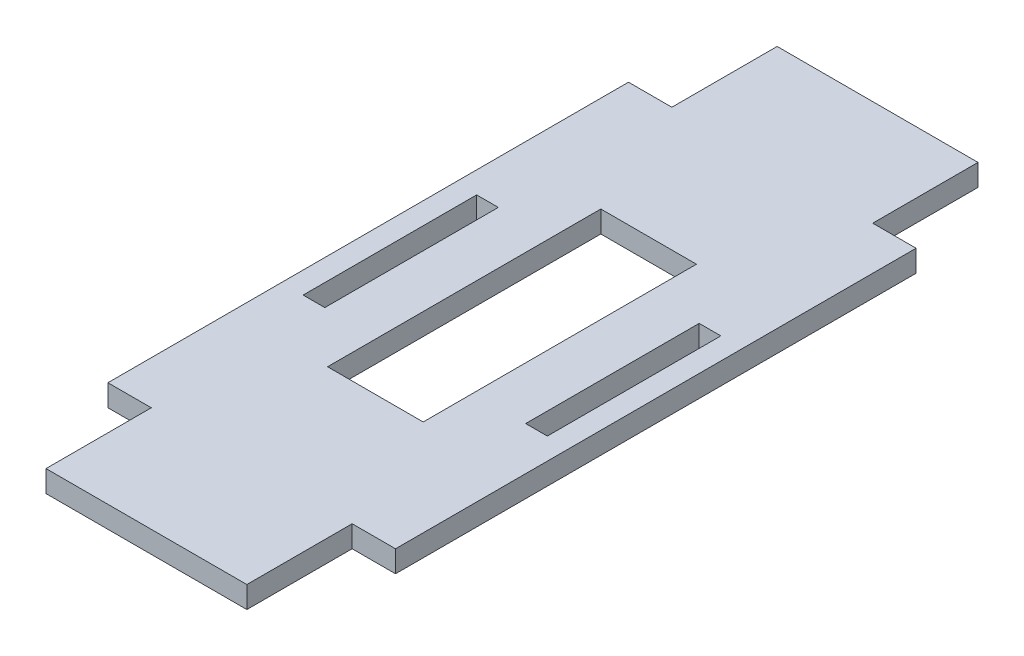
ISO-10303-21;
HEADER;
FILE_DESCRIPTION(('STEP AP214'),'2;1');
FILE_NAME('part.step','',(''),(''),'','','');
FILE_SCHEMA(('AUTOMOTIVE_DESIGN { 1 0 10303 214 1 1 1 1 }'));
ENDSEC;
DATA;
#1=APPLICATION_CONTEXT('core data for automotive mechanical design processes');
#2=APPLICATION_PROTOCOL_DEFINITION('international standard','automotive_design',2000,#1);
#3=PRODUCT_CONTEXT('',#1,'mechanical');
#4=PRODUCT('Part','Part','',(#3));
#5=PRODUCT_RELATED_PRODUCT_CATEGORY('part','',(#4));
#6=PRODUCT_DEFINITION_FORMATION('','',#4);
#7=PRODUCT_DEFINITION_CONTEXT('part definition',#1,'design');
#8=PRODUCT_DEFINITION('design','',#6,#7);
#9=PRODUCT_DEFINITION_SHAPE('','',#8);
#10=(LENGTH_UNIT() NAMED_UNIT(*) SI_UNIT(.MILLI.,.METRE.));
#11=(NAMED_UNIT(*) PLANE_ANGLE_UNIT() SI_UNIT($,.RADIAN.));
#12=(NAMED_UNIT(*) SI_UNIT($,.STERADIAN.) SOLID_ANGLE_UNIT());
#13=UNCERTAINTY_MEASURE_WITH_UNIT(LENGTH_MEASURE(1.E-05),#10,'distance_accuracy_value','');
#14=(GEOMETRIC_REPRESENTATION_CONTEXT(3) GLOBAL_UNCERTAINTY_ASSIGNED_CONTEXT((#13)) GLOBAL_UNIT_ASSIGNED_CONTEXT((#10,
#11,#12)) REPRESENTATION_CONTEXT('',''));
#15=CARTESIAN_POINT('',(0.,0.,0.));
#16=DIRECTION('',(0.,0.,1.));
#17=DIRECTION('',(1.,0.,0.));
#18=AXIS2_PLACEMENT_3D('',#15,#16,#17);
#19=CARTESIAN_POINT('',(0.,3.175,38.1));
#20=DIRECTION('',(0.,0.,-1.));
#21=DIRECTION('',(-1.,0.,0.));
#22=AXIS2_PLACEMENT_3D('',#19,#20,#21);
#23=PLANE('',#22);
#24=DIRECTION('',(1.,0.,0.));
#25=VECTOR('',#24,1.);
#26=CARTESIAN_POINT('',(0.,0.,38.1));
#27=LINE('',#26,#25);
#28=CARTESIAN_POINT('',(-21.05,0.,38.1));
#29=VERTEX_POINT('',#28);
#30=CARTESIAN_POINT('',(-14.7,0.,38.1));
#31=VERTEX_POINT('',#30);
#32=EDGE_CURVE('E271',#29,#31,#27,.T.);
#33=ORIENTED_EDGE('',*,*,#32,.T.);
#34=DIRECTION('',(0.,-1.,0.));
#35=VECTOR('',#34,1.);
#36=CARTESIAN_POINT('',(-14.7,3.175,38.1));
#37=LINE('',#36,#35);
#38=CARTESIAN_POINT('',(-14.7,3.175,38.1));
#39=VERTEX_POINT('',#38);
#40=EDGE_CURVE('E11',#39,#31,#37,.T.);
#41=ORIENTED_EDGE('',*,*,#40,.F.);
#42=DIRECTION('',(1.,0.,0.));
#43=VECTOR('',#42,1.);
#44=CARTESIAN_POINT('',(0.,3.175,38.1));
#45=LINE('',#44,#43);
#46=CARTESIAN_POINT('',(-21.05,3.175,38.1));
#47=VERTEX_POINT('',#46);
#48=EDGE_CURVE('E391',#47,#39,#45,.T.);
#49=ORIENTED_EDGE('',*,*,#48,.F.);
#50=DIRECTION('',(0.,-1.,0.));
#51=VECTOR('',#50,1.);
#52=CARTESIAN_POINT('',(-21.05,3.175,38.1));
#53=LINE('',#52,#51);
#54=EDGE_CURVE('E296',#47,#29,#53,.T.);
#55=ORIENTED_EDGE('',*,*,#54,.T.);
#56=EDGE_LOOP('',(#33,#41,#49,#55));
#57=FACE_BOUND('',#56,.T.);
#58=ADVANCED_FACE('F41',(#57),#23,.F.);
#59=CARTESIAN_POINT('',(-14.7,3.175,0.));
#60=DIRECTION('',(1.,0.,0.));
#61=DIRECTION('',(0.,0.,-1.));
#62=AXIS2_PLACEMENT_3D('',#59,#60,#61);
#63=PLANE('',#62);
#64=DIRECTION('',(0.,0.,1.));
#65=VECTOR('',#64,1.);
#66=CARTESIAN_POINT('',(-14.7,0.,0.));
#67=LINE('',#66,#65);
#68=CARTESIAN_POINT('',(-14.7,0.,53.51285));
#69=VERTEX_POINT('',#68);
#70=EDGE_CURVE('E274',#31,#69,#67,.T.);
#71=ORIENTED_EDGE('',*,*,#70,.T.);
#72=DIRECTION('',(0.,-1.,0.));
#73=VECTOR('',#72,1.);
#74=CARTESIAN_POINT('',(-14.7,3.175,53.51285));
#75=LINE('',#74,#73);
#76=CARTESIAN_POINT('',(-14.7,3.175,53.51285));
#77=VERTEX_POINT('',#76);
#78=EDGE_CURVE('E51',#77,#69,#75,.T.);
#79=ORIENTED_EDGE('',*,*,#78,.F.);
#80=DIRECTION('',(0.,0.,1.));
#81=VECTOR('',#80,1.);
#82=CARTESIAN_POINT('',(-14.7,3.175,0.));
#83=LINE('',#82,#81);
#84=EDGE_CURVE('E393',#39,#77,#83,.T.);
#85=ORIENTED_EDGE('',*,*,#84,.F.);
#86=ORIENTED_EDGE('',*,*,#40,.T.);
#87=EDGE_LOOP('',(#71,#79,#85,#86));
#88=FACE_BOUND('',#87,.T.);
#89=ADVANCED_FACE('F437',(#88),#63,.F.);
#90=CARTESIAN_POINT('',(0.,3.175,53.51285));
#91=DIRECTION('',(0.,0.,-1.));
#92=DIRECTION('',(-1.,0.,0.));
#93=AXIS2_PLACEMENT_3D('',#90,#91,#92);
#94=PLANE('',#93);
#95=DIRECTION('',(1.,0.,0.));
#96=VECTOR('',#95,1.);
#97=CARTESIAN_POINT('',(0.,0.,53.51285));
#98=LINE('',#97,#96);
#99=CARTESIAN_POINT('',(14.7,0.,53.51285));
#100=VERTEX_POINT('',#99);
#101=EDGE_CURVE('E276',#69,#100,#98,.T.);
#102=ORIENTED_EDGE('',*,*,#101,.T.);
#103=DIRECTION('',(0.,-1.,0.));
#104=VECTOR('',#103,1.);
#105=CARTESIAN_POINT('',(14.7,3.175,53.51285));
#106=LINE('',#105,#104);
#107=CARTESIAN_POINT('',(14.7,3.175,53.51285));
#108=VERTEX_POINT('',#107);
#109=EDGE_CURVE('E314',#108,#100,#106,.T.);
#110=ORIENTED_EDGE('',*,*,#109,.F.);
#111=DIRECTION('',(1.,0.,0.));
#112=VECTOR('',#111,1.);
#113=CARTESIAN_POINT('',(0.,3.175,53.51285));
#114=LINE('',#113,#112);
#115=EDGE_CURVE('E395',#77,#108,#114,.T.);
#116=ORIENTED_EDGE('',*,*,#115,.F.);
#117=ORIENTED_EDGE('',*,*,#78,.T.);
#118=EDGE_LOOP('',(#102,#110,#116,#117));
#119=FACE_BOUND('',#118,.T.);
#120=ADVANCED_FACE('F442',(#119),#94,.F.);
#121=CARTESIAN_POINT('',(14.7,3.175,0.));
#122=DIRECTION('',(-1.,0.,0.));
#123=DIRECTION('',(0.,0.,1.));
#124=AXIS2_PLACEMENT_3D('',#121,#122,#123);
#125=PLANE('',#124);
#126=DIRECTION('',(0.,0.,-1.));
#127=VECTOR('',#126,1.);
#128=CARTESIAN_POINT('',(14.7,0.,0.));
#129=LINE('',#128,#127);
#130=CARTESIAN_POINT('',(14.7,0.,38.1));
#131=VERTEX_POINT('',#130);
#132=EDGE_CURVE('E278',#100,#131,#129,.T.);
#133=ORIENTED_EDGE('',*,*,#132,.T.);
#134=DIRECTION('',(0.,-1.,0.));
#135=VECTOR('',#134,1.);
#136=CARTESIAN_POINT('',(14.7,3.175,38.1));
#137=LINE('',#136,#135);
#138=CARTESIAN_POINT('',(14.7,3.175,38.1));
#139=VERTEX_POINT('',#138);
#140=EDGE_CURVE('E311',#139,#131,#137,.T.);
#141=ORIENTED_EDGE('',*,*,#140,.F.);
#142=DIRECTION('',(0.,0.,-1.));
#143=VECTOR('',#142,1.);
#144=CARTESIAN_POINT('',(14.7,3.175,0.));
#145=LINE('',#144,#143);
#146=EDGE_CURVE('E397',#108,#139,#145,.T.);
#147=ORIENTED_EDGE('',*,*,#146,.F.);
#148=ORIENTED_EDGE('',*,*,#109,.T.);
#149=EDGE_LOOP('',(#133,#141,#147,#148));
#150=FACE_BOUND('',#149,.T.);
#151=ADVANCED_FACE('F570',(#150),#125,.F.);
#152=CARTESIAN_POINT('',(0.,3.175,38.1));
#153=DIRECTION('',(0.,0.,-1.));
#154=DIRECTION('',(-1.,0.,0.));
#155=AXIS2_PLACEMENT_3D('',#152,#153,#154);
#156=PLANE('',#155);
#157=DIRECTION('',(1.,0.,0.));
#158=VECTOR('',#157,1.);
#159=CARTESIAN_POINT('',(0.,0.,38.1));
#160=LINE('',#159,#158);
#161=CARTESIAN_POINT('',(21.05,0.,38.1));
#162=VERTEX_POINT('',#161);
#163=EDGE_CURVE('E280',#131,#162,#160,.T.);
#164=ORIENTED_EDGE('',*,*,#163,.T.);
#165=DIRECTION('',(0.,-1.,0.));
#166=VECTOR('',#165,1.);
#167=CARTESIAN_POINT('',(21.05,3.175,38.1));
#168=LINE('',#167,#166);
#169=CARTESIAN_POINT('',(21.05,3.175,38.1));
#170=VERTEX_POINT('',#169);
#171=EDGE_CURVE('E309',#170,#162,#168,.T.);
#172=ORIENTED_EDGE('',*,*,#171,.F.);
#173=DIRECTION('',(1.,0.,0.));
#174=VECTOR('',#173,1.);
#175=CARTESIAN_POINT('',(0.,3.175,38.1));
#176=LINE('',#175,#174);
#177=EDGE_CURVE('E399',#139,#170,#176,.T.);
#178=ORIENTED_EDGE('',*,*,#177,.F.);
#179=ORIENTED_EDGE('',*,*,#140,.T.);
#180=EDGE_LOOP('',(#164,#172,#178,#179));
#181=FACE_BOUND('',#180,.T.);
#182=ADVANCED_FACE('F561',(#181),#156,.F.);
#183=CARTESIAN_POINT('',(21.05,3.175,0.));
#184=DIRECTION('',(1.,0.,0.));
#185=DIRECTION('',(0.,0.,-1.));
#186=AXIS2_PLACEMENT_3D('',#183,#184,#185);
#187=PLANE('',#186);
#188=DIRECTION('',(0.,0.,1.));
#189=VECTOR('',#188,1.);
#190=CARTESIAN_POINT('',(21.05,0.,0.));
#191=LINE('',#190,#189);
#192=CARTESIAN_POINT('',(21.05,0.,-38.1));
#193=VERTEX_POINT('',#192);
#194=EDGE_CURVE('E283',#193,#162,#191,.T.);
#195=ORIENTED_EDGE('',*,*,#194,.F.);
#196=DIRECTION('',(0.,-1.,0.));
#197=VECTOR('',#196,1.);
#198=CARTESIAN_POINT('',(21.05,3.175,-38.1));
#199=LINE('',#198,#197);
#200=CARTESIAN_POINT('',(21.05,3.175,-38.1));
#201=VERTEX_POINT('',#200);
#202=EDGE_CURVE('E307',#201,#193,#199,.T.);
#203=ORIENTED_EDGE('',*,*,#202,.F.);
#204=DIRECTION('',(0.,0.,1.));
#205=VECTOR('',#204,1.);
#206=CARTESIAN_POINT('',(21.05,3.175,0.));
#207=LINE('',#206,#205);
#208=EDGE_CURVE('E401',#201,#170,#207,.T.);
#209=ORIENTED_EDGE('',*,*,#208,.T.);
#210=ORIENTED_EDGE('',*,*,#171,.T.);
#211=EDGE_LOOP('',(#195,#203,#209,#210));
#212=FACE_BOUND('',#211,.T.);
#213=ADVANCED_FACE('F552',(#212),#187,.T.);
#214=CARTESIAN_POINT('',(0.,3.175,-38.1));
#215=DIRECTION('',(0.,0.,1.));
#216=DIRECTION('',(1.,0.,0.));
#217=AXIS2_PLACEMENT_3D('',#214,#215,#216);
#218=PLANE('',#217);
#219=DIRECTION('',(-1.,0.,0.));
#220=VECTOR('',#219,1.);
#221=CARTESIAN_POINT('',(0.,0.,-38.1));
#222=LINE('',#221,#220);
#223=CARTESIAN_POINT('',(14.7,0.,-38.1));
#224=VERTEX_POINT('',#223);
#225=EDGE_CURVE('E286',#193,#224,#222,.T.);
#226=ORIENTED_EDGE('',*,*,#225,.T.);
#227=DIRECTION('',(0.,-1.,0.));
#228=VECTOR('',#227,1.);
#229=CARTESIAN_POINT('',(14.7,3.175,-38.1));
#230=LINE('',#229,#228);
#231=CARTESIAN_POINT('',(14.7,3.175,-38.1));
#232=VERTEX_POINT('',#231);
#233=EDGE_CURVE('E304',#232,#224,#230,.T.);
#234=ORIENTED_EDGE('',*,*,#233,.F.);
#235=DIRECTION('',(-1.,0.,0.));
#236=VECTOR('',#235,1.);
#237=CARTESIAN_POINT('',(0.,3.175,-38.1));
#238=LINE('',#237,#236);
#239=EDGE_CURVE('E404',#201,#232,#238,.T.);
#240=ORIENTED_EDGE('',*,*,#239,.F.);
#241=ORIENTED_EDGE('',*,*,#202,.T.);
#242=EDGE_LOOP('',(#226,#234,#240,#241));
#243=FACE_BOUND('',#242,.T.);
#244=ADVANCED_FACE('F544',(#243),#218,.F.);
#245=CARTESIAN_POINT('',(14.7,3.175,0.));
#246=DIRECTION('',(-1.,0.,0.));
#247=DIRECTION('',(0.,0.,1.));
#248=AXIS2_PLACEMENT_3D('',#245,#246,#247);
#249=PLANE('',#248);
#250=DIRECTION('',(0.,0.,-1.));
#251=VECTOR('',#250,1.);
#252=CARTESIAN_POINT('',(14.7,0.,0.));
#253=LINE('',#252,#251);
#254=CARTESIAN_POINT('',(14.7,0.,-53.51285));
#255=VERTEX_POINT('',#254);
#256=EDGE_CURVE('E288',#224,#255,#253,.T.);
#257=ORIENTED_EDGE('',*,*,#256,.T.);
#258=DIRECTION('',(0.,-1.,0.));
#259=VECTOR('',#258,1.);
#260=CARTESIAN_POINT('',(14.7,3.175,-53.51285));
#261=LINE('',#260,#259);
#262=CARTESIAN_POINT('',(14.7,3.175,-53.51285));
#263=VERTEX_POINT('',#262);
#264=EDGE_CURVE('E301',#263,#255,#261,.T.);
#265=ORIENTED_EDGE('',*,*,#264,.F.);
#266=DIRECTION('',(0.,0.,-1.));
#267=VECTOR('',#266,1.);
#268=CARTESIAN_POINT('',(14.7,3.175,0.));
#269=LINE('',#268,#267);
#270=EDGE_CURVE('E406',#232,#263,#269,.T.);
#271=ORIENTED_EDGE('',*,*,#270,.F.);
#272=ORIENTED_EDGE('',*,*,#233,.T.);
#273=EDGE_LOOP('',(#257,#265,#271,#272));
#274=FACE_BOUND('',#273,.T.);
#275=ADVANCED_FACE('F413',(#274),#249,.F.);
#276=CARTESIAN_POINT('',(0.,3.175,-53.51285));
#277=DIRECTION('',(0.,0.,1.));
#278=DIRECTION('',(1.,0.,0.));
#279=AXIS2_PLACEMENT_3D('',#276,#277,#278);
#280=PLANE('',#279);
#281=DIRECTION('',(-1.,0.,0.));
#282=VECTOR('',#281,1.);
#283=CARTESIAN_POINT('',(0.,0.,-53.51285));
#284=LINE('',#283,#282);
#285=CARTESIAN_POINT('',(-14.7,0.,-53.51285));
#286=VERTEX_POINT('',#285);
#287=EDGE_CURVE('E290',#255,#286,#284,.T.);
#288=ORIENTED_EDGE('',*,*,#287,.T.);
#289=DIRECTION('',(0.,-1.,0.));
#290=VECTOR('',#289,1.);
#291=CARTESIAN_POINT('',(-14.7,3.175,-53.51285));
#292=LINE('',#291,#290);
#293=CARTESIAN_POINT('',(-14.7,3.175,-53.51285));
#294=VERTEX_POINT('',#293);
#295=EDGE_CURVE('E228',#294,#286,#292,.T.);
#296=ORIENTED_EDGE('',*,*,#295,.F.);
#297=DIRECTION('',(-1.,0.,0.));
#298=VECTOR('',#297,1.);
#299=CARTESIAN_POINT('',(0.,3.175,-53.51285));
#300=LINE('',#299,#298);
#301=EDGE_CURVE('E219',#263,#294,#300,.T.);
#302=ORIENTED_EDGE('',*,*,#301,.F.);
#303=ORIENTED_EDGE('',*,*,#264,.T.);
#304=EDGE_LOOP('',(#288,#296,#302,#303));
#305=FACE_BOUND('',#304,.T.);
#306=ADVANCED_FACE('F417',(#305),#280,.F.);
#307=CARTESIAN_POINT('',(-14.7,3.175,0.));
#308=DIRECTION('',(1.,0.,0.));
#309=DIRECTION('',(0.,0.,-1.));
#310=AXIS2_PLACEMENT_3D('',#307,#308,#309);
#311=PLANE('',#310);
#312=DIRECTION('',(0.,0.,1.));
#313=VECTOR('',#312,1.);
#314=CARTESIAN_POINT('',(-14.7,0.,0.));
#315=LINE('',#314,#313);
#316=CARTESIAN_POINT('',(-14.7,0.,-38.1));
#317=VERTEX_POINT('',#316);
#318=EDGE_CURVE('E227',#286,#317,#315,.T.);
#319=ORIENTED_EDGE('',*,*,#318,.T.);
#320=DIRECTION('',(0.,-1.,0.));
#321=VECTOR('',#320,1.);
#322=CARTESIAN_POINT('',(-14.7,3.175,-38.1));
#323=LINE('',#322,#321);
#324=CARTESIAN_POINT('',(-14.7,3.175,-38.1));
#325=VERTEX_POINT('',#324);
#326=EDGE_CURVE('E224',#325,#317,#323,.T.);
#327=ORIENTED_EDGE('',*,*,#326,.F.);
#328=DIRECTION('',(0.,0.,1.));
#329=VECTOR('',#328,1.);
#330=CARTESIAN_POINT('',(-14.7,3.175,0.));
#331=LINE('',#330,#329);
#332=EDGE_CURVE('E213',#294,#325,#331,.T.);
#333=ORIENTED_EDGE('',*,*,#332,.F.);
#334=ORIENTED_EDGE('',*,*,#295,.T.);
#335=EDGE_LOOP('',(#319,#327,#333,#334));
#336=FACE_BOUND('',#335,.T.);
#337=ADVANCED_FACE('F225',(#336),#311,.F.);
#338=CARTESIAN_POINT('',(0.,3.175,-38.1));
#339=DIRECTION('',(0.,0.,1.));
#340=DIRECTION('',(1.,0.,0.));
#341=AXIS2_PLACEMENT_3D('',#338,#339,#340);
#342=PLANE('',#341);
#343=DIRECTION('',(-1.,0.,0.));
#344=VECTOR('',#343,1.);
#345=CARTESIAN_POINT('',(0.,0.,-38.1));
#346=LINE('',#345,#344);
#347=CARTESIAN_POINT('',(-21.05,0.,-38.1));
#348=VERTEX_POINT('',#347);
#349=EDGE_CURVE('E137',#317,#348,#346,.T.);
#350=ORIENTED_EDGE('',*,*,#349,.T.);
#351=DIRECTION('',(0.,-1.,0.));
#352=VECTOR('',#351,1.);
#353=CARTESIAN_POINT('',(-21.05,3.175,-38.1));
#354=LINE('',#353,#352);
#355=CARTESIAN_POINT('',(-21.05,3.175,-38.1));
#356=VERTEX_POINT('',#355);
#357=EDGE_CURVE('E229',#356,#348,#354,.T.);
#358=ORIENTED_EDGE('',*,*,#357,.F.);
#359=DIRECTION('',(-1.,0.,0.));
#360=VECTOR('',#359,1.);
#361=CARTESIAN_POINT('',(0.,3.175,-38.1));
#362=LINE('',#361,#360);
#363=EDGE_CURVE('E217',#325,#356,#362,.T.);
#364=ORIENTED_EDGE('',*,*,#363,.F.);
#365=ORIENTED_EDGE('',*,*,#326,.T.);
#366=EDGE_LOOP('',(#350,#358,#364,#365));
#367=FACE_BOUND('',#366,.T.);
#368=ADVANCED_FACE('F231',(#367),#342,.F.);
#369=CARTESIAN_POINT('',(7.,3.175,0.));
#370=DIRECTION('',(-1.,0.,0.));
#371=DIRECTION('',(0.,0.,1.));
#372=AXIS2_PLACEMENT_3D('',#369,#370,#371);
#373=PLANE('',#372);
#374=DIRECTION('',(0.,0.,-1.));
#375=VECTOR('',#374,1.);
#376=CARTESIAN_POINT('',(7.,0.,0.));
#377=LINE('',#376,#375);
#378=CARTESIAN_POINT('',(7.,0.,20.));
#379=VERTEX_POINT('',#378);
#380=CARTESIAN_POINT('',(7.,0.,-20.));
#381=VERTEX_POINT('',#380);
#382=EDGE_CURVE('E259',#379,#381,#377,.T.);
#383=ORIENTED_EDGE('',*,*,#382,.F.);
#384=DIRECTION('',(0.,-1.,0.));
#385=VECTOR('',#384,1.);
#386=CARTESIAN_POINT('',(7.,3.175,20.));
#387=LINE('',#386,#385);
#388=CARTESIAN_POINT('',(7.,3.175,20.));
#389=VERTEX_POINT('',#388);
#390=EDGE_CURVE('E298',#389,#379,#387,.T.);
#391=ORIENTED_EDGE('',*,*,#390,.F.);
#392=DIRECTION('',(0.,0.,-1.));
#393=VECTOR('',#392,1.);
#394=CARTESIAN_POINT('',(7.,3.175,0.));
#395=LINE('',#394,#393);
#396=CARTESIAN_POINT('',(7.,3.175,-20.));
#397=VERTEX_POINT('',#396);
#398=EDGE_CURVE('E380',#389,#397,#395,.T.);
#399=ORIENTED_EDGE('',*,*,#398,.T.);
#400=DIRECTION('',(0.,-1.,0.));
#401=VECTOR('',#400,1.);
#402=CARTESIAN_POINT('',(7.,3.175,-20.));
#403=LINE('',#402,#401);
#404=EDGE_CURVE('E319',#397,#381,#403,.T.);
#405=ORIENTED_EDGE('',*,*,#404,.T.);
#406=EDGE_LOOP('',(#383,#391,#399,#405));
#407=FACE_BOUND('',#406,.T.);
#408=ADVANCED_FACE('F459',(#407),#373,.T.);
#409=CARTESIAN_POINT('',(0.,3.175,20.));
#410=DIRECTION('',(0.,0.,-1.));
#411=DIRECTION('',(-1.,0.,0.));
#412=AXIS2_PLACEMENT_3D('',#409,#410,#411);
#413=PLANE('',#412);
#414=DIRECTION('',(1.,0.,0.));
#415=VECTOR('',#414,1.);
#416=CARTESIAN_POINT('',(0.,0.,20.));
#417=LINE('',#416,#415);
#418=CARTESIAN_POINT('',(-7.,0.,20.));
#419=VERTEX_POINT('',#418);
#420=EDGE_CURVE('E262',#419,#379,#417,.T.);
#421=ORIENTED_EDGE('',*,*,#420,.F.);
#422=DIRECTION('',(0.,-1.,0.));
#423=VECTOR('',#422,1.);
#424=CARTESIAN_POINT('',(-7.,3.175,20.));
#425=LINE('',#424,#423);
#426=CARTESIAN_POINT('',(-7.,3.175,20.));
#427=VERTEX_POINT('',#426);
#428=EDGE_CURVE('E325',#427,#419,#425,.T.);
#429=ORIENTED_EDGE('',*,*,#428,.F.);
#430=DIRECTION('',(1.,0.,0.));
#431=VECTOR('',#430,1.);
#432=CARTESIAN_POINT('',(0.,3.175,20.));
#433=LINE('',#432,#431);
#434=EDGE_CURVE('E383',#427,#389,#433,.T.);
#435=ORIENTED_EDGE('',*,*,#434,.T.);
#436=ORIENTED_EDGE('',*,*,#390,.T.);
#437=EDGE_LOOP('',(#421,#429,#435,#436));
#438=FACE_BOUND('',#437,.T.);
#439=ADVANCED_FACE('F455',(#438),#413,.T.);
#440=CARTESIAN_POINT('',(-7.,3.175,0.));
#441=DIRECTION('',(-1.,0.,0.));
#442=DIRECTION('',(0.,0.,1.));
#443=AXIS2_PLACEMENT_3D('',#440,#441,#442);
#444=PLANE('',#443);
#445=DIRECTION('',(0.,0.,-1.));
#446=VECTOR('',#445,1.);
#447=CARTESIAN_POINT('',(-7.,0.,0.));
#448=LINE('',#447,#446);
#449=CARTESIAN_POINT('',(-7.,0.,-20.));
#450=VERTEX_POINT('',#449);
#451=EDGE_CURVE('E265',#419,#450,#448,.T.);
#452=ORIENTED_EDGE('',*,*,#451,.T.);
#453=DIRECTION('',(0.,-1.,0.));
#454=VECTOR('',#453,1.);
#455=CARTESIAN_POINT('',(-7.,3.175,-20.));
#456=LINE('',#455,#454);
#457=CARTESIAN_POINT('',(-7.,3.175,-20.));
#458=VERTEX_POINT('',#457);
#459=EDGE_CURVE('E321',#458,#450,#456,.T.);
#460=ORIENTED_EDGE('',*,*,#459,.F.);
#461=DIRECTION('',(0.,0.,-1.));
#462=VECTOR('',#461,1.);
#463=CARTESIAN_POINT('',(-7.,3.175,0.));
#464=LINE('',#463,#462);
#465=EDGE_CURVE('E386',#427,#458,#464,.T.);
#466=ORIENTED_EDGE('',*,*,#465,.F.);
#467=ORIENTED_EDGE('',*,*,#428,.T.);
#468=EDGE_LOOP('',(#452,#460,#466,#467));
#469=FACE_BOUND('',#468,.T.);
#470=ADVANCED_FACE('F451',(#469),#444,.F.);
#471=CARTESIAN_POINT('',(-17.875,3.175,0.));
#472=DIRECTION('',(1.,0.,0.));
#473=DIRECTION('',(0.,0.,-1.));
#474=AXIS2_PLACEMENT_3D('',#471,#472,#473);
#475=PLANE('',#474);
#476=DIRECTION('',(0.,0.,1.));
#477=VECTOR('',#476,1.);
#478=CARTESIAN_POINT('',(-17.875,0.,0.));
#479=LINE('',#478,#477);
#480=CARTESIAN_POINT('',(-17.875,0.,-12.7));
#481=VERTEX_POINT('',#480);
#482=CARTESIAN_POINT('',(-17.875,0.,12.7));
#483=VERTEX_POINT('',#482);
#484=EDGE_CURVE('E247',#481,#483,#479,.T.);
#485=ORIENTED_EDGE('',*,*,#484,.F.);
#486=DIRECTION('',(0.,-1.,0.));
#487=VECTOR('',#486,1.);
#488=CARTESIAN_POINT('',(-17.875,3.175,-12.7));
#489=LINE('',#488,#487);
#490=CARTESIAN_POINT('',(-17.875,3.175,-12.7));
#491=VERTEX_POINT('',#490);
#492=EDGE_CURVE('E322',#491,#481,#489,.T.);
#493=ORIENTED_EDGE('',*,*,#492,.F.);
#494=DIRECTION('',(0.,0.,1.));
#495=VECTOR('',#494,1.);
#496=CARTESIAN_POINT('',(-17.875,3.175,0.));
#497=LINE('',#496,#495);
#498=CARTESIAN_POINT('',(-17.875,3.175,12.7));
#499=VERTEX_POINT('',#498);
#500=EDGE_CURVE('E365',#491,#499,#497,.T.);
#501=ORIENTED_EDGE('',*,*,#500,.T.);
#502=DIRECTION('',(0.,-1.,0.));
#503=VECTOR('',#502,1.);
#504=CARTESIAN_POINT('',(-17.875,3.175,12.7));
#505=LINE('',#504,#503);
#506=EDGE_CURVE('E328',#499,#483,#505,.T.);
#507=ORIENTED_EDGE('',*,*,#506,.T.);
#508=EDGE_LOOP('',(#485,#493,#501,#507));
#509=FACE_BOUND('',#508,.T.);
#510=ADVANCED_FACE('F454',(#509),#475,.T.);
#511=CARTESIAN_POINT('',(0.,3.175,-12.7));
#512=DIRECTION('',(0.,0.,-1.));
#513=DIRECTION('',(-1.,0.,0.));
#514=AXIS2_PLACEMENT_3D('',#511,#512,#513);
#515=PLANE('',#514);
#516=DIRECTION('',(1.,0.,0.));
#517=VECTOR('',#516,1.);
#518=CARTESIAN_POINT('',(0.,0.,-12.7));
#519=LINE('',#518,#517);
#520=CARTESIAN_POINT('',(-14.7,0.,-12.7));
#521=VERTEX_POINT('',#520);
#522=EDGE_CURVE('E250',#481,#521,#519,.T.);
#523=ORIENTED_EDGE('',*,*,#522,.T.);
#524=DIRECTION('',(0.,-1.,0.));
#525=VECTOR('',#524,1.);
#526=CARTESIAN_POINT('',(-14.7,3.175,-12.7));
#527=LINE('',#526,#525);
#528=CARTESIAN_POINT('',(-14.7,3.175,-12.7));
#529=VERTEX_POINT('',#528);
#530=EDGE_CURVE('E333',#529,#521,#527,.T.);
#531=ORIENTED_EDGE('',*,*,#530,.F.);
#532=DIRECTION('',(1.,0.,0.));
#533=VECTOR('',#532,1.);
#534=CARTESIAN_POINT('',(0.,3.175,-12.7));
#535=LINE('',#534,#533);
#536=EDGE_CURVE('E372',#491,#529,#535,.T.);
#537=ORIENTED_EDGE('',*,*,#536,.F.);
#538=ORIENTED_EDGE('',*,*,#492,.T.);
#539=EDGE_LOOP('',(#523,#531,#537,#538));
#540=FACE_BOUND('',#539,.T.);
#541=ADVANCED_FACE('F470',(#540),#515,.F.);
#542=CARTESIAN_POINT('',(-14.7,3.175,0.));
#543=DIRECTION('',(1.,0.,0.));
#544=DIRECTION('',(0.,0.,-1.));
#545=AXIS2_PLACEMENT_3D('',#542,#543,#544);
#546=PLANE('',#545);
#547=DIRECTION('',(0.,0.,1.));
#548=VECTOR('',#547,1.);
#549=CARTESIAN_POINT('',(-14.7,0.,0.));
#550=LINE('',#549,#548);
#551=CARTESIAN_POINT('',(-14.7,0.,12.7));
#552=VERTEX_POINT('',#551);
#553=EDGE_CURVE('E253',#521,#552,#550,.T.);
#554=ORIENTED_EDGE('',*,*,#553,.T.);
#555=DIRECTION('',(0.,-1.,0.));
#556=VECTOR('',#555,1.);
#557=CARTESIAN_POINT('',(-14.7,3.175,12.7));
#558=LINE('',#557,#556);
#559=CARTESIAN_POINT('',(-14.7,3.175,12.7));
#560=VERTEX_POINT('',#559);
#561=EDGE_CURVE('E330',#560,#552,#558,.T.);
#562=ORIENTED_EDGE('',*,*,#561,.F.);
#563=DIRECTION('',(0.,0.,1.));
#564=VECTOR('',#563,1.);
#565=CARTESIAN_POINT('',(-14.7,3.175,0.));
#566=LINE('',#565,#564);
#567=EDGE_CURVE('E375',#529,#560,#566,.T.);
#568=ORIENTED_EDGE('',*,*,#567,.F.);
#569=ORIENTED_EDGE('',*,*,#530,.T.);
#570=EDGE_LOOP('',(#554,#562,#568,#569));
#571=FACE_BOUND('',#570,.T.);
#572=ADVANCED_FACE('F467',(#571),#546,.F.);
#573=CARTESIAN_POINT('',(17.875,3.175,0.));
#574=DIRECTION('',(-1.,0.,0.));
#575=DIRECTION('',(0.,0.,1.));
#576=AXIS2_PLACEMENT_3D('',#573,#574,#575);
#577=PLANE('',#576);
#578=DIRECTION('',(0.,0.,-1.));
#579=VECTOR('',#578,1.);
#580=CARTESIAN_POINT('',(17.875,0.,0.));
#581=LINE('',#580,#579);
#582=CARTESIAN_POINT('',(17.875,0.,12.7));
#583=VERTEX_POINT('',#582);
#584=CARTESIAN_POINT('',(17.875,0.,-12.7));
#585=VERTEX_POINT('',#584);
#586=EDGE_CURVE('E237',#583,#585,#581,.T.);
#587=ORIENTED_EDGE('',*,*,#586,.F.);
#588=DIRECTION('',(0.,-1.,0.));
#589=VECTOR('',#588,1.);
#590=CARTESIAN_POINT('',(17.875,3.175,12.7));
#591=LINE('',#590,#589);
#592=CARTESIAN_POINT('',(17.875,3.175,12.7));
#593=VERTEX_POINT('',#592);
#594=EDGE_CURVE('E45',#593,#583,#591,.T.);
#595=ORIENTED_EDGE('',*,*,#594,.F.);
#596=DIRECTION('',(0.,0.,-1.));
#597=VECTOR('',#596,1.);
#598=CARTESIAN_POINT('',(17.875,3.175,0.));
#599=LINE('',#598,#597);
#600=CARTESIAN_POINT('',(17.875,3.175,-12.7));
#601=VERTEX_POINT('',#600);
#602=EDGE_CURVE('E295',#593,#601,#599,.T.);
#603=ORIENTED_EDGE('',*,*,#602,.T.);
#604=DIRECTION('',(0.,-1.,0.));
#605=VECTOR('',#604,1.);
#606=CARTESIAN_POINT('',(17.875,3.175,-12.7));
#607=LINE('',#606,#605);
#608=EDGE_CURVE('E233',#601,#585,#607,.T.);
#609=ORIENTED_EDGE('',*,*,#608,.T.);
#610=EDGE_LOOP('',(#587,#595,#603,#609));
#611=FACE_BOUND('',#610,.T.);
#612=ADVANCED_FACE('F43',(#611),#577,.T.);
#613=CARTESIAN_POINT('',(0.,3.175,12.7));
#614=DIRECTION('',(0.,0.,1.));
#615=DIRECTION('',(1.,0.,0.));
#616=AXIS2_PLACEMENT_3D('',#613,#614,#615);
#617=PLANE('',#616);
#618=DIRECTION('',(-1.,0.,0.));
#619=VECTOR('',#618,1.);
#620=CARTESIAN_POINT('',(0.,0.,12.7));
#621=LINE('',#620,#619);
#622=CARTESIAN_POINT('',(14.7,0.,12.7));
#623=VERTEX_POINT('',#622);
#624=EDGE_CURVE('E240',#583,#623,#621,.T.);
#625=ORIENTED_EDGE('',*,*,#624,.T.);
#626=DIRECTION('',(0.,-1.,0.));
#627=VECTOR('',#626,1.);
#628=CARTESIAN_POINT('',(14.7,3.175,12.7));
#629=LINE('',#628,#627);
#630=CARTESIAN_POINT('',(14.7,3.175,12.7));
#631=VERTEX_POINT('',#630);
#632=EDGE_CURVE('E340',#631,#623,#629,.T.);
#633=ORIENTED_EDGE('',*,*,#632,.F.);
#634=DIRECTION('',(-1.,0.,0.));
#635=VECTOR('',#634,1.);
#636=CARTESIAN_POINT('',(0.,3.175,12.7));
#637=LINE('',#636,#635);
#638=EDGE_CURVE('E349',#593,#631,#637,.T.);
#639=ORIENTED_EDGE('',*,*,#638,.F.);
#640=ORIENTED_EDGE('',*,*,#594,.T.);
#641=EDGE_LOOP('',(#625,#633,#639,#640));
#642=FACE_BOUND('',#641,.T.);
#643=ADVANCED_FACE('F348',(#642),#617,.F.);
#644=CARTESIAN_POINT('',(14.7,3.175,0.));
#645=DIRECTION('',(-1.,0.,0.));
#646=DIRECTION('',(0.,0.,1.));
#647=AXIS2_PLACEMENT_3D('',#644,#645,#646);
#648=PLANE('',#647);
#649=DIRECTION('',(0.,0.,-1.));
#650=VECTOR('',#649,1.);
#651=CARTESIAN_POINT('',(14.7,0.,0.));
#652=LINE('',#651,#650);
#653=CARTESIAN_POINT('',(14.7,0.,-12.7));
#654=VERTEX_POINT('',#653);
#655=EDGE_CURVE('E242',#623,#654,#652,.T.);
#656=ORIENTED_EDGE('',*,*,#655,.T.);
#657=DIRECTION('',(0.,-1.,0.));
#658=VECTOR('',#657,1.);
#659=CARTESIAN_POINT('',(14.7,3.175,-12.7));
#660=LINE('',#659,#658);
#661=CARTESIAN_POINT('',(14.7,3.175,-12.7));
#662=VERTEX_POINT('',#661);
#663=EDGE_CURVE('E338',#662,#654,#660,.T.);
#664=ORIENTED_EDGE('',*,*,#663,.F.);
#665=DIRECTION('',(0.,0.,-1.));
#666=VECTOR('',#665,1.);
#667=CARTESIAN_POINT('',(14.7,3.175,0.));
#668=LINE('',#667,#666);
#669=EDGE_CURVE('E362',#631,#662,#668,.T.);
#670=ORIENTED_EDGE('',*,*,#669,.F.);
#671=ORIENTED_EDGE('',*,*,#632,.T.);
#672=EDGE_LOOP('',(#656,#664,#670,#671));
#673=FACE_BOUND('',#672,.T.);
#674=ADVANCED_FACE('F361',(#673),#648,.F.);
#675=CARTESIAN_POINT('',(0.,3.175,-20.));
#676=DIRECTION('',(0.,0.,-1.));
#677=DIRECTION('',(-1.,0.,0.));
#678=AXIS2_PLACEMENT_3D('',#675,#676,#677);
#679=PLANE('',#678);
#680=DIRECTION('',(1.,0.,0.));
#681=VECTOR('',#680,1.);
#682=CARTESIAN_POINT('',(0.,0.,-20.));
#683=LINE('',#682,#681);
#684=EDGE_CURVE('E268',#450,#381,#683,.T.);
#685=ORIENTED_EDGE('',*,*,#684,.T.);
#686=ORIENTED_EDGE('',*,*,#404,.F.);
#687=DIRECTION('',(1.,0.,0.));
#688=VECTOR('',#687,1.);
#689=CARTESIAN_POINT('',(0.,3.175,-20.));
#690=LINE('',#689,#688);
#691=EDGE_CURVE('E389',#458,#397,#690,.T.);
#692=ORIENTED_EDGE('',*,*,#691,.F.);
#693=ORIENTED_EDGE('',*,*,#459,.T.);
#694=EDGE_LOOP('',(#685,#686,#692,#693));
#695=FACE_BOUND('',#694,.T.);
#696=ADVANCED_FACE('F447',(#695),#679,.F.);
#697=CARTESIAN_POINT('',(0.,3.175,12.7));
#698=DIRECTION('',(0.,0.,1.));
#699=DIRECTION('',(1.,0.,0.));
#700=AXIS2_PLACEMENT_3D('',#697,#698,#699);
#701=PLANE('',#700);
#702=DIRECTION('',(-1.,0.,0.));
#703=VECTOR('',#702,1.);
#704=CARTESIAN_POINT('',(0.,0.,12.7));
#705=LINE('',#704,#703);
#706=EDGE_CURVE('E256',#552,#483,#705,.T.);
#707=ORIENTED_EDGE('',*,*,#706,.T.);
#708=ORIENTED_EDGE('',*,*,#506,.F.);
#709=DIRECTION('',(-1.,0.,0.));
#710=VECTOR('',#709,1.);
#711=CARTESIAN_POINT('',(0.,3.175,12.7));
#712=LINE('',#711,#710);
#713=EDGE_CURVE('E378',#560,#499,#712,.T.);
#714=ORIENTED_EDGE('',*,*,#713,.F.);
#715=ORIENTED_EDGE('',*,*,#561,.T.);
#716=EDGE_LOOP('',(#707,#708,#714,#715));
#717=FACE_BOUND('',#716,.T.);
#718=ADVANCED_FACE('F432',(#717),#701,.F.);
#719=CARTESIAN_POINT('',(0.,3.175,-12.7));
#720=DIRECTION('',(0.,0.,-1.));
#721=DIRECTION('',(-1.,0.,0.));
#722=AXIS2_PLACEMENT_3D('',#719,#720,#721);
#723=PLANE('',#722);
#724=DIRECTION('',(1.,0.,0.));
#725=VECTOR('',#724,1.);
#726=CARTESIAN_POINT('',(0.,0.,-12.7));
#727=LINE('',#726,#725);
#728=EDGE_CURVE('E244',#654,#585,#727,.T.);
#729=ORIENTED_EDGE('',*,*,#728,.T.);
#730=ORIENTED_EDGE('',*,*,#608,.F.);
#731=DIRECTION('',(1.,0.,0.));
#732=VECTOR('',#731,1.);
#733=CARTESIAN_POINT('',(0.,3.175,-12.7));
#734=LINE('',#733,#732);
#735=EDGE_CURVE('E360',#662,#601,#734,.T.);
#736=ORIENTED_EDGE('',*,*,#735,.F.);
#737=ORIENTED_EDGE('',*,*,#663,.T.);
#738=EDGE_LOOP('',(#729,#730,#736,#737));
#739=FACE_BOUND('',#738,.T.);
#740=ADVANCED_FACE('F358',(#739),#723,.F.);
#741=CARTESIAN_POINT('',(-21.05,3.175,0.));
#742=DIRECTION('',(1.,0.,0.));
#743=DIRECTION('',(0.,0.,-1.));
#744=AXIS2_PLACEMENT_3D('',#741,#742,#743);
#745=PLANE('',#744);
#746=DIRECTION('',(0.,0.,1.));
#747=VECTOR('',#746,1.);
#748=CARTESIAN_POINT('',(-21.05,0.,0.));
#749=LINE('',#748,#747);
#750=EDGE_CURVE('E143',#348,#29,#749,.T.);
#751=ORIENTED_EDGE('',*,*,#750,.T.);
#752=ORIENTED_EDGE('',*,*,#54,.F.);
#753=DIRECTION('',(0.,0.,1.));
#754=VECTOR('',#753,1.);
#755=CARTESIAN_POINT('',(-21.05,3.175,0.));
#756=LINE('',#755,#754);
#757=EDGE_CURVE('E60',#356,#47,#756,.T.);
#758=ORIENTED_EDGE('',*,*,#757,.F.);
#759=ORIENTED_EDGE('',*,*,#357,.T.);
#760=EDGE_LOOP('',(#751,#752,#758,#759));
#761=FACE_BOUND('',#760,.T.);
#762=ADVANCED_FACE('F424',(#761),#745,.F.);
#763=CARTESIAN_POINT('',(0.,3.175,0.));
#764=DIRECTION('',(0.,1.,0.));
#765=DIRECTION('',(0.,0.,1.));
#766=AXIS2_PLACEMENT_3D('',#763,#764,#765);
#767=PLANE('',#766);
#768=ORIENTED_EDGE('',*,*,#602,.F.);
#769=ORIENTED_EDGE('',*,*,#638,.T.);
#770=ORIENTED_EDGE('',*,*,#669,.T.);
#771=ORIENTED_EDGE('',*,*,#735,.T.);
#772=EDGE_LOOP('',(#768,#769,#770,#771));
#773=FACE_BOUND('',#772,.T.);
#774=ORIENTED_EDGE('',*,*,#500,.F.);
#775=ORIENTED_EDGE('',*,*,#536,.T.);
#776=ORIENTED_EDGE('',*,*,#567,.T.);
#777=ORIENTED_EDGE('',*,*,#713,.T.);
#778=EDGE_LOOP('',(#774,#775,#776,#777));
#779=FACE_BOUND('',#778,.T.);
#780=ORIENTED_EDGE('',*,*,#398,.F.);
#781=ORIENTED_EDGE('',*,*,#434,.F.);
#782=ORIENTED_EDGE('',*,*,#465,.T.);
#783=ORIENTED_EDGE('',*,*,#691,.T.);
#784=EDGE_LOOP('',(#780,#781,#782,#783));
#785=FACE_BOUND('',#784,.T.);
#786=ORIENTED_EDGE('',*,*,#48,.T.);
#787=ORIENTED_EDGE('',*,*,#84,.T.);
#788=ORIENTED_EDGE('',*,*,#115,.T.);
#789=ORIENTED_EDGE('',*,*,#146,.T.);
#790=ORIENTED_EDGE('',*,*,#177,.T.);
#791=ORIENTED_EDGE('',*,*,#208,.F.);
#792=ORIENTED_EDGE('',*,*,#239,.T.);
#793=ORIENTED_EDGE('',*,*,#270,.T.);
#794=ORIENTED_EDGE('',*,*,#301,.T.);
#795=ORIENTED_EDGE('',*,*,#332,.T.);
#796=ORIENTED_EDGE('',*,*,#363,.T.);
#797=ORIENTED_EDGE('',*,*,#757,.T.);
#798=EDGE_LOOP('',(#786,#787,#788,#789,#790,#791,#792,#793,#794,#795,#796,#797));
#799=FACE_BOUND('',#798,.T.);
#800=ADVANCED_FACE('F215',(#773,#779,#785,#799),#767,.T.);
#801=CARTESIAN_POINT('',(0.,0.,0.));
#802=DIRECTION('',(0.,1.,0.));
#803=DIRECTION('',(0.,0.,1.));
#804=AXIS2_PLACEMENT_3D('',#801,#802,#803);
#805=PLANE('',#804);
#806=ORIENTED_EDGE('',*,*,#586,.T.);
#807=ORIENTED_EDGE('',*,*,#728,.F.);
#808=ORIENTED_EDGE('',*,*,#655,.F.);
#809=ORIENTED_EDGE('',*,*,#624,.F.);
#810=EDGE_LOOP('',(#806,#807,#808,#809));
#811=FACE_BOUND('',#810,.T.);
#812=ORIENTED_EDGE('',*,*,#484,.T.);
#813=ORIENTED_EDGE('',*,*,#706,.F.);
#814=ORIENTED_EDGE('',*,*,#553,.F.);
#815=ORIENTED_EDGE('',*,*,#522,.F.);
#816=EDGE_LOOP('',(#812,#813,#814,#815));
#817=FACE_BOUND('',#816,.T.);
#818=ORIENTED_EDGE('',*,*,#382,.T.);
#819=ORIENTED_EDGE('',*,*,#684,.F.);
#820=ORIENTED_EDGE('',*,*,#451,.F.);
#821=ORIENTED_EDGE('',*,*,#420,.T.);
#822=EDGE_LOOP('',(#818,#819,#820,#821));
#823=FACE_BOUND('',#822,.T.);
#824=ORIENTED_EDGE('',*,*,#32,.F.);
#825=ORIENTED_EDGE('',*,*,#750,.F.);
#826=ORIENTED_EDGE('',*,*,#349,.F.);
#827=ORIENTED_EDGE('',*,*,#318,.F.);
#828=ORIENTED_EDGE('',*,*,#287,.F.);
#829=ORIENTED_EDGE('',*,*,#256,.F.);
#830=ORIENTED_EDGE('',*,*,#225,.F.);
#831=ORIENTED_EDGE('',*,*,#194,.T.);
#832=ORIENTED_EDGE('',*,*,#163,.F.);
#833=ORIENTED_EDGE('',*,*,#132,.F.);
#834=ORIENTED_EDGE('',*,*,#101,.F.);
#835=ORIENTED_EDGE('',*,*,#70,.F.);
#836=EDGE_LOOP('',(#824,#825,#826,#827,#828,#829,#830,#831,#832,#833,#834,#835));
#837=FACE_BOUND('',#836,.T.);
#838=ADVANCED_FACE('F352',(#811,#817,#823,#837),#805,.F.);
#839=CLOSED_SHELL('',(#58,#89,#120,#151,#182,#213,#244,#275,#306,#337,#368,#408,#439,#470,#510,
#541,#572,#612,#643,#674,#696,#718,#740,#762,#800,#838));
#840=MANIFOLD_SOLID_BREP('B2',#839);
#841=ADVANCED_BREP_SHAPE_REPRESENTATION('',(#18,#840),#14);
#842=SHAPE_DEFINITION_REPRESENTATION(#9,#841);
ENDSEC;
END-ISO-10303-21;
